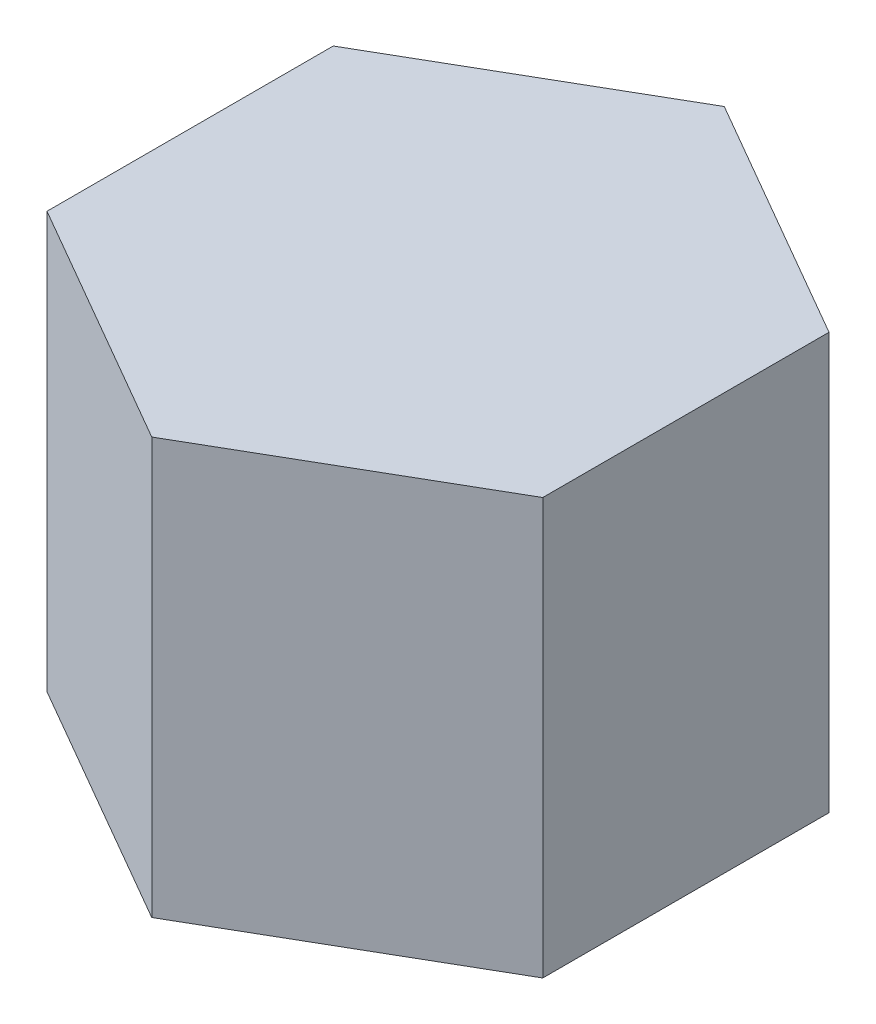
ISO-10303-21;
HEADER;
FILE_DESCRIPTION(('STEP AP214'),'2;1');
FILE_NAME('part.step','',(''),(''),'','','');
FILE_SCHEMA(('AUTOMOTIVE_DESIGN { 1 0 10303 214 1 1 1 1 }'));
ENDSEC;
DATA;
#1=APPLICATION_CONTEXT('core data for automotive mechanical design processes');
#2=APPLICATION_PROTOCOL_DEFINITION('international standard','automotive_design',2000,#1);
#3=PRODUCT_CONTEXT('',#1,'mechanical');
#4=PRODUCT('Part','Part','',(#3));
#5=PRODUCT_RELATED_PRODUCT_CATEGORY('part','',(#4));
#6=PRODUCT_DEFINITION_FORMATION('','',#4);
#7=PRODUCT_DEFINITION_CONTEXT('part definition',#1,'design');
#8=PRODUCT_DEFINITION('design','',#6,#7);
#9=PRODUCT_DEFINITION_SHAPE('','',#8);
#10=(LENGTH_UNIT() NAMED_UNIT(*) SI_UNIT(.MILLI.,.METRE.));
#11=(NAMED_UNIT(*) PLANE_ANGLE_UNIT() SI_UNIT($,.RADIAN.));
#12=(NAMED_UNIT(*) SI_UNIT($,.STERADIAN.) SOLID_ANGLE_UNIT());
#13=UNCERTAINTY_MEASURE_WITH_UNIT(LENGTH_MEASURE(1.E-05),#10,'distance_accuracy_value','');
#14=(GEOMETRIC_REPRESENTATION_CONTEXT(3) GLOBAL_UNCERTAINTY_ASSIGNED_CONTEXT((#13)) GLOBAL_UNIT_ASSIGNED_CONTEXT((#10,
#11,#12)) REPRESENTATION_CONTEXT('',''));
#15=CARTESIAN_POINT('',(0.,0.,0.));
#16=DIRECTION('',(0.,0.,1.));
#17=DIRECTION('',(1.,0.,0.));
#18=AXIS2_PLACEMENT_3D('',#15,#16,#17);
#19=CARTESIAN_POINT('',(204.839551417382,-147.556598747966,296.012098239417));
#20=DIRECTION('',(-0.500000000000096,0.,-0.866025403784383));
#21=DIRECTION('',(-0.866025403784383,0.,0.500000000000096));
#22=AXIS2_PLACEMENT_3D('',#19,#20,#21);
#23=PLANE('',#22);
#24=CARTESIAN_POINT('',(205.142660308706,-147.047793579175,295.837098239417));
#25=DIRECTION('',(-0.866025403784383,0.,0.500000000000096));
#26=VECTOR('',#25,1.);
#27=LINE('',#24,#26);
#28=CARTESIAN_POINT('',(205.142660308706,-147.047793579175,295.837098239417));
#29=VERTEX_POINT('',#28);
#30=CARTESIAN_POINT('',(204.839551417382,-147.047793579175,296.012098239417));
#31=VERTEX_POINT('',#30);
#32=EDGE_CURVE('E170',#29,#31,#27,.T.);
#33=ORIENTED_EDGE('',*,*,#32,.T.);
#34=CARTESIAN_POINT('',(204.839551417382,-147.556598747966,296.012098239417));
#35=DIRECTION('',(0.,1.,0.));
#36=VECTOR('',#35,1.);
#37=LINE('',#34,#36);
#38=CARTESIAN_POINT('',(204.839551417382,-147.556598747966,296.012098239417));
#39=VERTEX_POINT('',#38);
#40=EDGE_CURVE('E35',#39,#31,#37,.T.);
#41=ORIENTED_EDGE('',*,*,#40,.F.);
#42=CARTESIAN_POINT('',(205.142660308706,-147.556598747966,295.837098239417));
#43=DIRECTION('',(-0.866025403784383,0.,0.500000000000096));
#44=VECTOR('',#43,1.);
#45=LINE('',#42,#44);
#46=CARTESIAN_POINT('',(205.142660308706,-147.556598747966,295.837098239417));
#47=VERTEX_POINT('',#46);
#48=EDGE_CURVE('E159',#47,#39,#45,.T.);
#49=ORIENTED_EDGE('',*,*,#48,.F.);
#50=CARTESIAN_POINT('',(205.142660308706,-147.556598747966,295.837098239417));
#51=DIRECTION('',(0.,1.,0.));
#52=VECTOR('',#51,1.);
#53=LINE('',#50,#52);
#54=EDGE_CURVE('E10',#47,#29,#53,.T.);
#55=ORIENTED_EDGE('',*,*,#54,.T.);
#56=EDGE_LOOP('',(#33,#41,#49,#55));
#57=FACE_BOUND('',#56,.T.);
#58=ADVANCED_FACE('F16',(#57),#23,.F.);
#59=CARTESIAN_POINT('',(205.142660308706,-147.556598747966,291.594471220494));
#60=DIRECTION('',(-1.,0.,0.));
#61=DIRECTION('',(0.,-1.,0.));
#62=AXIS2_PLACEMENT_3D('',#59,#60,#61);
#63=PLANE('',#62);
#64=CARTESIAN_POINT('',(205.142660308706,-147.047793579175,295.487098239417));
#65=DIRECTION('',(0.,0.,1.));
#66=VECTOR('',#65,1.);
#67=LINE('',#64,#66);
#68=CARTESIAN_POINT('',(205.142660308706,-147.047793579175,295.487098239417));
#69=VERTEX_POINT('',#68);
#70=EDGE_CURVE('E167',#69,#29,#67,.T.);
#71=ORIENTED_EDGE('',*,*,#70,.T.);
#72=ORIENTED_EDGE('',*,*,#54,.F.);
#73=CARTESIAN_POINT('',(205.142660308706,-147.556598747966,295.487098239417));
#74=DIRECTION('',(0.,0.,1.));
#75=VECTOR('',#74,1.);
#76=LINE('',#73,#75);
#77=CARTESIAN_POINT('',(205.142660308706,-147.556598747966,295.487098239417));
#78=VERTEX_POINT('',#77);
#79=EDGE_CURVE('E156',#78,#47,#76,.T.);
#80=ORIENTED_EDGE('',*,*,#79,.F.);
#81=CARTESIAN_POINT('',(205.142660308706,-147.556598747966,295.487098239417));
#82=DIRECTION('',(0.,1.,0.));
#83=VECTOR('',#82,1.);
#84=LINE('',#81,#83);
#85=EDGE_CURVE('E27',#78,#69,#84,.T.);
#86=ORIENTED_EDGE('',*,*,#85,.T.);
#87=EDGE_LOOP('',(#71,#72,#80,#86));
#88=FACE_BOUND('',#87,.T.);
#89=ADVANCED_FACE('F189',(#88),#63,.F.);
#90=CARTESIAN_POINT('',(205.142660308706,-147.556598747966,295.487098239417));
#91=DIRECTION('',(-0.500000000000062,0.,0.866025403784403));
#92=DIRECTION('',(0.866025403784403,0.,0.500000000000062));
#93=AXIS2_PLACEMENT_3D('',#90,#91,#92);
#94=PLANE('',#93);
#95=CARTESIAN_POINT('',(204.839551417382,-147.047793579175,295.312098239417));
#96=DIRECTION('',(0.866025403784403,0.,0.500000000000062));
#97=VECTOR('',#96,1.);
#98=LINE('',#95,#97);
#99=CARTESIAN_POINT('',(204.839551417382,-147.047793579175,295.312098239417));
#100=VERTEX_POINT('',#99);
#101=EDGE_CURVE('E163',#100,#69,#98,.T.);
#102=ORIENTED_EDGE('',*,*,#101,.T.);
#103=ORIENTED_EDGE('',*,*,#85,.F.);
#104=CARTESIAN_POINT('',(204.839551417382,-147.556598747966,295.312098239417));
#105=DIRECTION('',(0.866025403784403,0.,0.500000000000062));
#106=VECTOR('',#105,1.);
#107=LINE('',#104,#106);
#108=CARTESIAN_POINT('',(204.839551417382,-147.556598747966,295.312098239417));
#109=VERTEX_POINT('',#108);
#110=EDGE_CURVE('E106',#109,#78,#107,.T.);
#111=ORIENTED_EDGE('',*,*,#110,.F.);
#112=CARTESIAN_POINT('',(204.839551417382,-147.556598747966,295.312098239417));
#113=DIRECTION('',(0.,1.,0.));
#114=VECTOR('',#113,1.);
#115=LINE('',#112,#114);
#116=EDGE_CURVE('E94',#109,#100,#115,.T.);
#117=ORIENTED_EDGE('',*,*,#116,.T.);
#118=EDGE_LOOP('',(#102,#103,#111,#117));
#119=FACE_BOUND('',#118,.T.);
#120=ADVANCED_FACE('F198',(#119),#94,.F.);
#121=CARTESIAN_POINT('',(204.839551417382,-147.556598747966,295.312098239417));
#122=DIRECTION('',(0.500000000000096,0.,0.866025403784383));
#123=DIRECTION('',(0.866025403784383,0.,-0.500000000000096));
#124=AXIS2_PLACEMENT_3D('',#121,#122,#123);
#125=PLANE('',#124);
#126=CARTESIAN_POINT('',(204.536442526057,-147.047793579175,295.487098239417));
#127=DIRECTION('',(0.866025403784383,0.,-0.500000000000096));
#128=VECTOR('',#127,1.);
#129=LINE('',#126,#128);
#130=CARTESIAN_POINT('',(204.536442526057,-147.047793579175,295.487098239417));
#131=VERTEX_POINT('',#130);
#132=EDGE_CURVE('E162',#131,#100,#129,.T.);
#133=ORIENTED_EDGE('',*,*,#132,.T.);
#134=ORIENTED_EDGE('',*,*,#116,.F.);
#135=CARTESIAN_POINT('',(204.536442526057,-147.556598747966,295.487098239417));
#136=DIRECTION('',(0.866025403784383,0.,-0.500000000000096));
#137=VECTOR('',#136,1.);
#138=LINE('',#135,#137);
#139=CARTESIAN_POINT('',(204.536442526057,-147.556598747966,295.487098239417));
#140=VERTEX_POINT('',#139);
#141=EDGE_CURVE('E98',#140,#109,#138,.T.);
#142=ORIENTED_EDGE('',*,*,#141,.F.);
#143=CARTESIAN_POINT('',(204.536442526057,-147.556598747966,295.487098239417));
#144=DIRECTION('',(0.,1.,0.));
#145=VECTOR('',#144,1.);
#146=LINE('',#143,#145);
#147=EDGE_CURVE('E79',#140,#131,#146,.T.);
#148=ORIENTED_EDGE('',*,*,#147,.T.);
#149=EDGE_LOOP('',(#133,#134,#142,#148));
#150=FACE_BOUND('',#149,.T.);
#151=ADVANCED_FACE('F100',(#150),#125,.F.);
#152=CARTESIAN_POINT('',(204.536442526057,-147.556598747966,291.594471220494));
#153=DIRECTION('',(1.,0.,0.));
#154=DIRECTION('',(0.,1.,0.));
#155=AXIS2_PLACEMENT_3D('',#152,#153,#154);
#156=PLANE('',#155);
#157=CARTESIAN_POINT('',(204.536442526057,-147.047793579175,295.837098239417));
#158=DIRECTION('',(0.,0.,-1.));
#159=VECTOR('',#158,1.);
#160=LINE('',#157,#159);
#161=CARTESIAN_POINT('',(204.536442526057,-147.047793579175,295.837098239417));
#162=VERTEX_POINT('',#161);
#163=EDGE_CURVE('E88',#162,#131,#160,.T.);
#164=ORIENTED_EDGE('',*,*,#163,.T.);
#165=ORIENTED_EDGE('',*,*,#147,.F.);
#166=CARTESIAN_POINT('',(204.536442526057,-147.556598747966,295.837098239417));
#167=DIRECTION('',(0.,0.,-1.));
#168=VECTOR('',#167,1.);
#169=LINE('',#166,#168);
#170=CARTESIAN_POINT('',(204.536442526057,-147.556598747966,295.837098239417));
#171=VERTEX_POINT('',#170);
#172=EDGE_CURVE('E84',#171,#140,#169,.T.);
#173=ORIENTED_EDGE('',*,*,#172,.F.);
#174=CARTESIAN_POINT('',(204.536442526057,-147.556598747966,295.837098239417));
#175=DIRECTION('',(0.,1.,0.));
#176=VECTOR('',#175,1.);
#177=LINE('',#174,#176);
#178=EDGE_CURVE('E58',#171,#162,#177,.T.);
#179=ORIENTED_EDGE('',*,*,#178,.T.);
#180=EDGE_LOOP('',(#164,#165,#173,#179));
#181=FACE_BOUND('',#180,.T.);
#182=ADVANCED_FACE('F82',(#181),#156,.F.);
#183=CARTESIAN_POINT('',(204.536442526057,-147.556598747966,295.837098239417));
#184=DIRECTION('',(0.500000000000062,0.,-0.866025403784403));
#185=DIRECTION('',(-0.866025403784403,0.,-0.500000000000062));
#186=AXIS2_PLACEMENT_3D('',#183,#184,#185);
#187=PLANE('',#186);
#188=CARTESIAN_POINT('',(204.839551417382,-147.047793579175,296.012098239417));
#189=DIRECTION('',(-0.866025403784403,0.,-0.500000000000062));
#190=VECTOR('',#189,1.);
#191=LINE('',#188,#190);
#192=EDGE_CURVE('E160',#31,#162,#191,.T.);
#193=ORIENTED_EDGE('',*,*,#192,.T.);
#194=ORIENTED_EDGE('',*,*,#178,.F.);
#195=CARTESIAN_POINT('',(204.839551417382,-147.556598747966,296.012098239417));
#196=DIRECTION('',(-0.866025403784403,0.,-0.500000000000062));
#197=VECTOR('',#196,1.);
#198=LINE('',#195,#197);
#199=EDGE_CURVE('E112',#39,#171,#198,.T.);
#200=ORIENTED_EDGE('',*,*,#199,.F.);
#201=ORIENTED_EDGE('',*,*,#40,.T.);
#202=EDGE_LOOP('',(#193,#194,#200,#201));
#203=FACE_BOUND('',#202,.T.);
#204=ADVANCED_FACE('F131',(#203),#187,.F.);
#205=CARTESIAN_POINT('',(206.491105863044,-147.556598747966,291.594471220494));
#206=DIRECTION('',(0.,1.,0.));
#207=DIRECTION('',(-1.,0.,0.));
#208=AXIS2_PLACEMENT_3D('',#205,#206,#207);
#209=PLANE('',#208);
#210=ORIENTED_EDGE('',*,*,#48,.T.);
#211=ORIENTED_EDGE('',*,*,#199,.T.);
#212=ORIENTED_EDGE('',*,*,#172,.T.);
#213=ORIENTED_EDGE('',*,*,#141,.T.);
#214=ORIENTED_EDGE('',*,*,#110,.T.);
#215=ORIENTED_EDGE('',*,*,#79,.T.);
#216=EDGE_LOOP('',(#210,#211,#212,#213,#214,#215));
#217=FACE_BOUND('',#216,.T.);
#218=ADVANCED_FACE('F111',(#217),#209,.F.);
#219=CARTESIAN_POINT('',(206.491105863044,-147.047793579175,291.594471220494));
#220=DIRECTION('',(0.,1.,0.));
#221=DIRECTION('',(-1.,0.,0.));
#222=AXIS2_PLACEMENT_3D('',#219,#220,#221);
#223=PLANE('',#222);
#224=ORIENTED_EDGE('',*,*,#32,.F.);
#225=ORIENTED_EDGE('',*,*,#70,.F.);
#226=ORIENTED_EDGE('',*,*,#101,.F.);
#227=ORIENTED_EDGE('',*,*,#132,.F.);
#228=ORIENTED_EDGE('',*,*,#163,.F.);
#229=ORIENTED_EDGE('',*,*,#192,.F.);
#230=EDGE_LOOP('',(#224,#225,#226,#227,#228,#229));
#231=FACE_BOUND('',#230,.T.);
#232=ADVANCED_FACE('F130',(#231),#223,.T.);
#233=CLOSED_SHELL('',(#58,#89,#120,#151,#182,#204,#218,#232));
#234=MANIFOLD_SOLID_BREP('B1',#233);
#235=ADVANCED_BREP_SHAPE_REPRESENTATION('',(#18,#234),#14);
#236=SHAPE_DEFINITION_REPRESENTATION(#9,#235);
ENDSEC;
END-ISO-10303-21;
